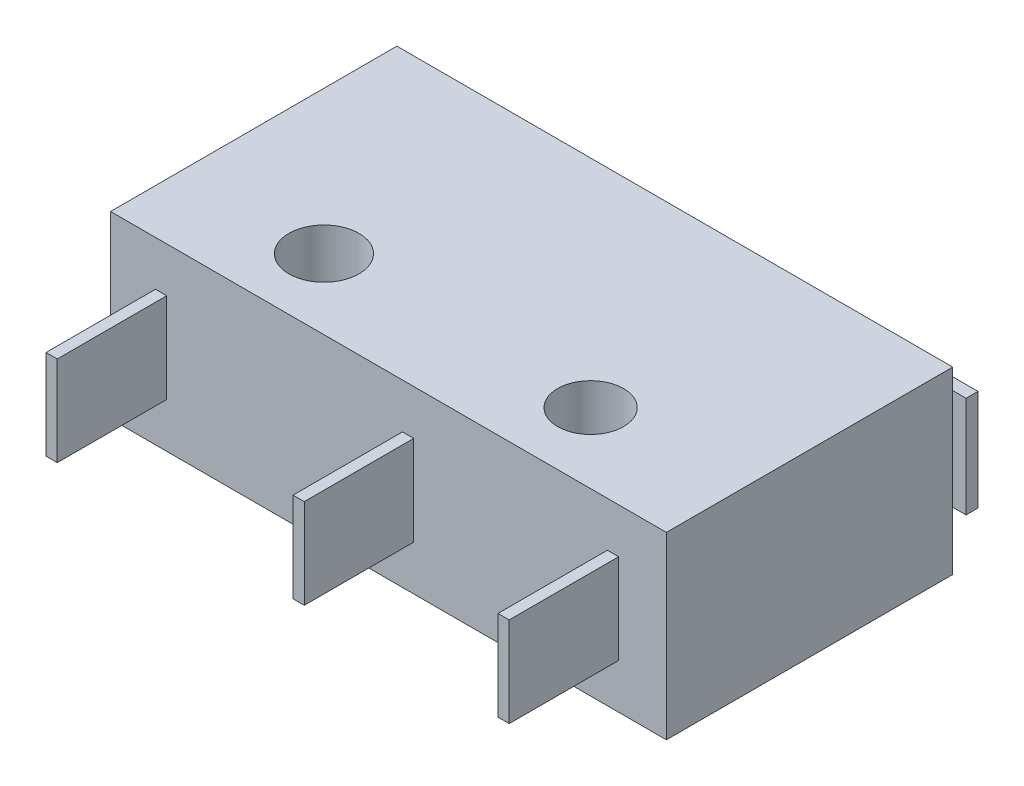
ISO-10303-21;
HEADER;
FILE_DESCRIPTION(('STEP AP214'),'2;1');
FILE_NAME('part.step','',(''),(''),'','','');
FILE_SCHEMA(('AUTOMOTIVE_DESIGN { 1 0 10303 214 1 1 1 1 }'));
ENDSEC;
DATA;
#1=APPLICATION_CONTEXT('core data for automotive mechanical design processes');
#2=APPLICATION_PROTOCOL_DEFINITION('international standard','automotive_design',2000,#1);
#3=PRODUCT_CONTEXT('',#1,'mechanical');
#4=PRODUCT('Part','Part','',(#3));
#5=PRODUCT_RELATED_PRODUCT_CATEGORY('part','',(#4));
#6=PRODUCT_DEFINITION_FORMATION('','',#4);
#7=PRODUCT_DEFINITION_CONTEXT('part definition',#1,'design');
#8=PRODUCT_DEFINITION('design','',#6,#7);
#9=PRODUCT_DEFINITION_SHAPE('','',#8);
#10=(LENGTH_UNIT() NAMED_UNIT(*) SI_UNIT(.MILLI.,.METRE.));
#11=(NAMED_UNIT(*) PLANE_ANGLE_UNIT() SI_UNIT($,.RADIAN.));
#12=(NAMED_UNIT(*) SI_UNIT($,.STERADIAN.) SOLID_ANGLE_UNIT());
#13=UNCERTAINTY_MEASURE_WITH_UNIT(LENGTH_MEASURE(1.E-05),#10,'distance_accuracy_value','');
#14=(GEOMETRIC_REPRESENTATION_CONTEXT(3) GLOBAL_UNCERTAINTY_ASSIGNED_CONTEXT((#13)) GLOBAL_UNIT_ASSIGNED_CONTEXT((#10,
#11,#12)) REPRESENTATION_CONTEXT('',''));
#15=CARTESIAN_POINT('',(0.,0.,0.));
#16=DIRECTION('',(0.,0.,1.));
#17=DIRECTION('',(1.,0.,0.));
#18=AXIS2_PLACEMENT_3D('',#15,#16,#17);
#19=CARTESIAN_POINT('',(-9.9,3.2,5.1));
#20=DIRECTION('',(0.,0.,-1.));
#21=DIRECTION('',(-1.,0.,0.));
#22=AXIS2_PLACEMENT_3D('',#19,#20,#21);
#23=PLANE('',#22);
#24=DIRECTION('',(0.,1.,0.));
#25=VECTOR('',#24,1.);
#26=CARTESIAN_POINT('',(0.9,1.6,5.1));
#27=LINE('',#26,#25);
#28=CARTESIAN_POINT('',(0.9,-1.6,5.1));
#29=VERTEX_POINT('',#28);
#30=CARTESIAN_POINT('',(0.9,1.6,5.1));
#31=VERTEX_POINT('',#30);
#32=EDGE_CURVE('E240',#29,#31,#27,.T.);
#33=ORIENTED_EDGE('',*,*,#32,.F.);
#34=DIRECTION('',(1.,0.,0.));
#35=VECTOR('',#34,1.);
#36=CARTESIAN_POINT('',(0.5,-1.6,5.1));
#37=LINE('',#36,#35);
#38=CARTESIAN_POINT('',(0.5,-1.6,5.1));
#39=VERTEX_POINT('',#38);
#40=EDGE_CURVE('E245',#39,#29,#37,.T.);
#41=ORIENTED_EDGE('',*,*,#40,.F.);
#42=DIRECTION('',(0.,-1.,0.));
#43=VECTOR('',#42,1.);
#44=CARTESIAN_POINT('',(0.5,1.6,5.1));
#45=LINE('',#44,#43);
#46=CARTESIAN_POINT('',(0.5,1.6,5.1));
#47=VERTEX_POINT('',#46);
#48=EDGE_CURVE('E257',#47,#39,#45,.T.);
#49=ORIENTED_EDGE('',*,*,#48,.F.);
#50=DIRECTION('',(-1.,0.,0.));
#51=VECTOR('',#50,1.);
#52=CARTESIAN_POINT('',(0.5,1.6,5.1));
#53=LINE('',#52,#51);
#54=EDGE_CURVE('E254',#31,#47,#53,.T.);
#55=ORIENTED_EDGE('',*,*,#54,.F.);
#56=EDGE_LOOP('',(#33,#41,#49,#55));
#57=FACE_BOUND('',#56,.T.);
#58=DIRECTION('',(1.,0.,0.));
#59=VECTOR('',#58,1.);
#60=CARTESIAN_POINT('',(-9.9,-3.2,5.1));
#61=LINE('',#60,#59);
#62=CARTESIAN_POINT('',(-9.9,-3.2,5.1));
#63=VERTEX_POINT('',#62);
#64=CARTESIAN_POINT('',(9.9,-3.2,5.1));
#65=VERTEX_POINT('',#64);
#66=EDGE_CURVE('E366',#63,#65,#61,.T.);
#67=ORIENTED_EDGE('',*,*,#66,.T.);
#68=DIRECTION('',(0.,-1.,0.));
#69=VECTOR('',#68,1.);
#70=CARTESIAN_POINT('',(9.9,3.2,5.1));
#71=LINE('',#70,#69);
#72=CARTESIAN_POINT('',(9.9,3.2,5.1));
#73=VERTEX_POINT('',#72);
#74=EDGE_CURVE('E372',#73,#65,#71,.T.);
#75=ORIENTED_EDGE('',*,*,#74,.F.);
#76=DIRECTION('',(1.,0.,0.));
#77=VECTOR('',#76,1.);
#78=CARTESIAN_POINT('',(-9.9,3.2,5.1));
#79=LINE('',#78,#77);
#80=CARTESIAN_POINT('',(-9.9,3.2,5.1));
#81=VERTEX_POINT('',#80);
#82=EDGE_CURVE('E370',#81,#73,#79,.T.);
#83=ORIENTED_EDGE('',*,*,#82,.F.);
#84=DIRECTION('',(0.,-1.,0.));
#85=VECTOR('',#84,1.);
#86=CARTESIAN_POINT('',(-9.9,3.2,5.1));
#87=LINE('',#86,#85);
#88=EDGE_CURVE('E382',#81,#63,#87,.T.);
#89=ORIENTED_EDGE('',*,*,#88,.T.);
#90=EDGE_LOOP('',(#67,#75,#83,#89));
#91=FACE_BOUND('',#90,.T.);
#92=DIRECTION('',(0.,1.,0.));
#93=VECTOR('',#92,1.);
#94=CARTESIAN_POINT('',(-7.9,1.6,5.1));
#95=LINE('',#94,#93);
#96=CARTESIAN_POINT('',(-7.9,-1.6,5.1));
#97=VERTEX_POINT('',#96);
#98=CARTESIAN_POINT('',(-7.9,1.6,5.1));
#99=VERTEX_POINT('',#98);
#100=EDGE_CURVE('E273',#97,#99,#95,.T.);
#101=ORIENTED_EDGE('',*,*,#100,.F.);
#102=DIRECTION('',(1.,0.,0.));
#103=VECTOR('',#102,1.);
#104=CARTESIAN_POINT('',(-8.3,-1.6,5.1));
#105=LINE('',#104,#103);
#106=CARTESIAN_POINT('',(-8.3,-1.6,5.1));
#107=VERTEX_POINT('',#106);
#108=EDGE_CURVE('E278',#107,#97,#105,.T.);
#109=ORIENTED_EDGE('',*,*,#108,.F.);
#110=DIRECTION('',(0.,-1.,0.));
#111=VECTOR('',#110,1.);
#112=CARTESIAN_POINT('',(-8.3,1.6,5.1));
#113=LINE('',#112,#111);
#114=CARTESIAN_POINT('',(-8.3,1.6,5.1));
#115=VERTEX_POINT('',#114);
#116=EDGE_CURVE('E290',#115,#107,#113,.T.);
#117=ORIENTED_EDGE('',*,*,#116,.F.);
#118=DIRECTION('',(-1.,0.,0.));
#119=VECTOR('',#118,1.);
#120=CARTESIAN_POINT('',(-8.3,1.6,5.1));
#121=LINE('',#120,#119);
#122=EDGE_CURVE('E287',#99,#115,#121,.T.);
#123=ORIENTED_EDGE('',*,*,#122,.F.);
#124=EDGE_LOOP('',(#101,#109,#117,#123));
#125=FACE_BOUND('',#124,.T.);
#126=DIRECTION('',(0.,1.,0.));
#127=VECTOR('',#126,1.);
#128=CARTESIAN_POINT('',(8.2,1.6,5.1));
#129=LINE('',#128,#127);
#130=CARTESIAN_POINT('',(8.2,-1.6,5.1));
#131=VERTEX_POINT('',#130);
#132=CARTESIAN_POINT('',(8.2,1.6,5.1));
#133=VERTEX_POINT('',#132);
#134=EDGE_CURVE('E205',#131,#133,#129,.T.);
#135=ORIENTED_EDGE('',*,*,#134,.F.);
#136=DIRECTION('',(1.,0.,0.));
#137=VECTOR('',#136,1.);
#138=CARTESIAN_POINT('',(7.8,-1.6,5.1));
#139=LINE('',#138,#137);
#140=CARTESIAN_POINT('',(7.8,-1.6,5.1));
#141=VERTEX_POINT('',#140);
#142=EDGE_CURVE('E212',#141,#131,#139,.T.);
#143=ORIENTED_EDGE('',*,*,#142,.F.);
#144=DIRECTION('',(0.,-1.,0.));
#145=VECTOR('',#144,1.);
#146=CARTESIAN_POINT('',(7.8,1.6,5.1));
#147=LINE('',#146,#145);
#148=CARTESIAN_POINT('',(7.8,1.6,5.1));
#149=VERTEX_POINT('',#148);
#150=EDGE_CURVE('E224',#149,#141,#147,.T.);
#151=ORIENTED_EDGE('',*,*,#150,.F.);
#152=DIRECTION('',(-1.,0.,0.));
#153=VECTOR('',#152,1.);
#154=CARTESIAN_POINT('',(7.8,1.6,5.1));
#155=LINE('',#154,#153);
#156=EDGE_CURVE('E221',#133,#149,#155,.T.);
#157=ORIENTED_EDGE('',*,*,#156,.F.);
#158=EDGE_LOOP('',(#135,#143,#151,#157));
#159=FACE_BOUND('',#158,.T.);
#160=ADVANCED_FACE('F34',(#57,#91,#125,#159),#23,.F.);
#161=CARTESIAN_POINT('',(-9.9,3.2,-5.1));
#162=DIRECTION('',(0.,0.,1.));
#163=DIRECTION('',(1.,0.,0.));
#164=AXIS2_PLACEMENT_3D('',#161,#162,#163);
#165=PLANE('',#164);
#166=DIRECTION('',(0.,-1.,0.));
#167=VECTOR('',#166,1.);
#168=CARTESIAN_POINT('',(-2.80029071826333,1.7,-5.1));
#169=LINE('',#168,#167);
#170=CARTESIAN_POINT('',(-2.80029071826333,1.7,-5.1));
#171=VERTEX_POINT('',#170);
#172=CARTESIAN_POINT('',(-2.80029071826333,-1.7,-5.1));
#173=VERTEX_POINT('',#172);
#174=EDGE_CURVE('E52',#171,#173,#169,.T.);
#175=ORIENTED_EDGE('',*,*,#174,.F.);
#176=DIRECTION('',(-1.,0.,0.));
#177=VECTOR('',#176,1.);
#178=CARTESIAN_POINT('',(-9.9,1.7,-5.1));
#179=LINE('',#178,#177);
#180=CARTESIAN_POINT('',(-3.81456377409336,1.7,-5.1));
#181=VERTEX_POINT('',#180);
#182=EDGE_CURVE('E11',#171,#181,#179,.T.);
#183=ORIENTED_EDGE('',*,*,#182,.T.);
#184=DIRECTION('',(0.,-1.,0.));
#185=VECTOR('',#184,1.);
#186=CARTESIAN_POINT('',(-3.81456377409336,1.7,-5.1));
#187=LINE('',#186,#185);
#188=CARTESIAN_POINT('',(-3.81456377409336,-1.7,-5.1));
#189=VERTEX_POINT('',#188);
#190=EDGE_CURVE('E42',#189,#181,#187,.F.);
#191=ORIENTED_EDGE('',*,*,#190,.F.);
#192=DIRECTION('',(-1.,0.,0.));
#193=VECTOR('',#192,1.);
#194=CARTESIAN_POINT('',(-9.9,-1.7,-5.1));
#195=LINE('',#194,#193);
#196=EDGE_CURVE('E191',#173,#189,#195,.T.);
#197=ORIENTED_EDGE('',*,*,#196,.F.);
#198=EDGE_LOOP('',(#175,#183,#191,#197));
#199=FACE_BOUND('',#198,.T.);
#200=DIRECTION('',(-1.,0.,0.));
#201=VECTOR('',#200,1.);
#202=CARTESIAN_POINT('',(-9.9,-3.2,-5.1));
#203=LINE('',#202,#201);
#204=CARTESIAN_POINT('',(9.9,-3.2,-5.1));
#205=VERTEX_POINT('',#204);
#206=CARTESIAN_POINT('',(-9.9,-3.2,-5.1));
#207=VERTEX_POINT('',#206);
#208=EDGE_CURVE('E375',#205,#207,#203,.T.);
#209=ORIENTED_EDGE('',*,*,#208,.T.);
#210=DIRECTION('',(0.,-1.,0.));
#211=VECTOR('',#210,1.);
#212=CARTESIAN_POINT('',(-9.9,3.2,-5.1));
#213=LINE('',#212,#211);
#214=CARTESIAN_POINT('',(-9.9,3.2,-5.1));
#215=VERTEX_POINT('',#214);
#216=EDGE_CURVE('E385',#215,#207,#213,.T.);
#217=ORIENTED_EDGE('',*,*,#216,.F.);
#218=DIRECTION('',(-1.,0.,0.));
#219=VECTOR('',#218,1.);
#220=CARTESIAN_POINT('',(-9.9,3.2,-5.1));
#221=LINE('',#220,#219);
#222=CARTESIAN_POINT('',(9.9,3.2,-5.1));
#223=VERTEX_POINT('',#222);
#224=EDGE_CURVE('E365',#223,#215,#221,.T.);
#225=ORIENTED_EDGE('',*,*,#224,.F.);
#226=DIRECTION('',(0.,-1.,0.));
#227=VECTOR('',#226,1.);
#228=CARTESIAN_POINT('',(9.9,3.2,-5.1));
#229=LINE('',#228,#227);
#230=EDGE_CURVE('E200',#223,#205,#229,.T.);
#231=ORIENTED_EDGE('',*,*,#230,.T.);
#232=EDGE_LOOP('',(#209,#217,#225,#231));
#233=FACE_BOUND('',#232,.T.);
#234=DIRECTION('',(1.,0.,0.));
#235=VECTOR('',#234,1.);
#236=CARTESIAN_POINT('',(-6.69422935085049,1.8,-5.1));
#237=LINE('',#236,#235);
#238=CARTESIAN_POINT('',(-7.3066351905182,1.8,-5.1));
#239=VERTEX_POINT('',#238);
#240=CARTESIAN_POINT('',(-6.69422935085049,1.8,-5.1));
#241=VERTEX_POINT('',#240);
#242=EDGE_CURVE('E307',#239,#241,#237,.T.);
#243=ORIENTED_EDGE('',*,*,#242,.F.);
#244=DIRECTION('',(0.,-1.,0.));
#245=VECTOR('',#244,1.);
#246=CARTESIAN_POINT('',(-7.3066351905182,1.8,-5.1));
#247=LINE('',#246,#245);
#248=CARTESIAN_POINT('',(-7.3066351905182,-1.8,-5.1));
#249=VERTEX_POINT('',#248);
#250=EDGE_CURVE('E321',#239,#249,#247,.T.);
#251=ORIENTED_EDGE('',*,*,#250,.T.);
#252=DIRECTION('',(1.,0.,0.));
#253=VECTOR('',#252,1.);
#254=CARTESIAN_POINT('',(-6.69422935085049,-1.8,-5.1));
#255=LINE('',#254,#253);
#256=CARTESIAN_POINT('',(-6.69422935085049,-1.8,-5.1));
#257=VERTEX_POINT('',#256);
#258=EDGE_CURVE('E306',#249,#257,#255,.T.);
#259=ORIENTED_EDGE('',*,*,#258,.T.);
#260=DIRECTION('',(0.,-1.,0.));
#261=VECTOR('',#260,1.);
#262=CARTESIAN_POINT('',(-6.69422935085049,1.8,-5.1));
#263=LINE('',#262,#261);
#264=EDGE_CURVE('E347',#241,#257,#263,.T.);
#265=ORIENTED_EDGE('',*,*,#264,.F.);
#266=EDGE_LOOP('',(#243,#251,#259,#265));
#267=FACE_BOUND('',#266,.T.);
#268=ADVANCED_FACE('F189',(#199,#233,#267),#165,.F.);
#269=CARTESIAN_POINT('',(9.9,3.2,5.1));
#270=DIRECTION('',(-1.,0.,0.));
#271=DIRECTION('',(0.,0.,1.));
#272=AXIS2_PLACEMENT_3D('',#269,#270,#271);
#273=PLANE('',#272);
#274=DIRECTION('',(0.,0.,-1.));
#275=VECTOR('',#274,1.);
#276=CARTESIAN_POINT('',(9.9,-3.2,5.1));
#277=LINE('',#276,#275);
#278=EDGE_CURVE('E357',#65,#205,#277,.T.);
#279=ORIENTED_EDGE('',*,*,#278,.T.);
#280=ORIENTED_EDGE('',*,*,#230,.F.);
#281=DIRECTION('',(0.,0.,-1.));
#282=VECTOR('',#281,1.);
#283=CARTESIAN_POINT('',(9.9,3.2,5.1));
#284=LINE('',#283,#282);
#285=EDGE_CURVE('E362',#73,#223,#284,.T.);
#286=ORIENTED_EDGE('',*,*,#285,.F.);
#287=ORIENTED_EDGE('',*,*,#74,.T.);
#288=EDGE_LOOP('',(#279,#280,#286,#287));
#289=FACE_BOUND('',#288,.T.);
#290=ADVANCED_FACE('F36',(#289),#273,.F.);
#291=CARTESIAN_POINT('',(-9.9,3.2,5.1));
#292=DIRECTION('',(1.,0.,0.));
#293=DIRECTION('',(0.,0.,-1.));
#294=AXIS2_PLACEMENT_3D('',#291,#292,#293);
#295=PLANE('',#294);
#296=DIRECTION('',(0.,0.,1.));
#297=VECTOR('',#296,1.);
#298=CARTESIAN_POINT('',(-9.9,-3.2,5.1));
#299=LINE('',#298,#297);
#300=EDGE_CURVE('E377',#207,#63,#299,.T.);
#301=ORIENTED_EDGE('',*,*,#300,.T.);
#302=ORIENTED_EDGE('',*,*,#88,.F.);
#303=DIRECTION('',(0.,0.,1.));
#304=VECTOR('',#303,1.);
#305=CARTESIAN_POINT('',(-9.9,3.2,5.1));
#306=LINE('',#305,#304);
#307=EDGE_CURVE('E368',#215,#81,#306,.T.);
#308=ORIENTED_EDGE('',*,*,#307,.F.);
#309=ORIENTED_EDGE('',*,*,#216,.T.);
#310=EDGE_LOOP('',(#301,#302,#308,#309));
#311=FACE_BOUND('',#310,.T.);
#312=ADVANCED_FACE('F403',(#311),#295,.F.);
#313=CARTESIAN_POINT('',(0.,3.2,0.));
#314=DIRECTION('',(0.,-1.,0.));
#315=DIRECTION('',(0.,0.,-1.));
#316=AXIS2_PLACEMENT_3D('',#313,#314,#315);
#317=PLANE('',#316);
#318=CARTESIAN_POINT('',(-4.8,3.2,2.6));
#319=DIRECTION('',(0.,1.,0.));
#320=DIRECTION('',(0.,0.,1.));
#321=AXIS2_PLACEMENT_3D('',#318,#319,#320);
#322=CIRCLE('',#321,1.25);
#323=CARTESIAN_POINT('',(-4.8,3.2,3.85));
#324=VERTEX_POINT('',#323);
#325=EDGE_CURVE('E350',#324,#324,#322,.T.);
#326=ORIENTED_EDGE('',*,*,#325,.F.);
#327=EDGE_LOOP('',(#326));
#328=FACE_BOUND('',#327,.T.);
#329=CARTESIAN_POINT('',(4.7,3.2,2.6));
#330=DIRECTION('',(0.,1.,0.));
#331=DIRECTION('',(0.,0.,1.));
#332=AXIS2_PLACEMENT_3D('',#329,#330,#331);
#333=CIRCLE('',#332,1.175);
#334=CARTESIAN_POINT('',(4.7,3.2,3.775));
#335=VERTEX_POINT('',#334);
#336=EDGE_CURVE('E349',#335,#335,#333,.T.);
#337=ORIENTED_EDGE('',*,*,#336,.F.);
#338=EDGE_LOOP('',(#337));
#339=FACE_BOUND('',#338,.T.);
#340=ORIENTED_EDGE('',*,*,#285,.T.);
#341=ORIENTED_EDGE('',*,*,#224,.T.);
#342=ORIENTED_EDGE('',*,*,#307,.T.);
#343=ORIENTED_EDGE('',*,*,#82,.T.);
#344=EDGE_LOOP('',(#340,#341,#342,#343));
#345=FACE_BOUND('',#344,.T.);
#346=ADVANCED_FACE('F409',(#328,#339,#345),#317,.F.);
#347=CARTESIAN_POINT('',(0.,-3.2,0.));
#348=DIRECTION('',(0.,-1.,0.));
#349=DIRECTION('',(0.,0.,-1.));
#350=AXIS2_PLACEMENT_3D('',#347,#348,#349);
#351=PLANE('',#350);
#352=CARTESIAN_POINT('',(-4.8,-3.2,2.6));
#353=DIRECTION('',(0.,1.,0.));
#354=DIRECTION('',(0.,0.,1.));
#355=AXIS2_PLACEMENT_3D('',#352,#353,#354);
#356=CIRCLE('',#355,1.25);
#357=CARTESIAN_POINT('',(-4.8,-3.2,3.85));
#358=VERTEX_POINT('',#357);
#359=EDGE_CURVE('E353',#358,#358,#356,.T.);
#360=ORIENTED_EDGE('',*,*,#359,.T.);
#361=EDGE_LOOP('',(#360));
#362=FACE_BOUND('',#361,.T.);
#363=CARTESIAN_POINT('',(4.7,-3.2,2.6));
#364=DIRECTION('',(0.,1.,0.));
#365=DIRECTION('',(0.,0.,1.));
#366=AXIS2_PLACEMENT_3D('',#363,#364,#365);
#367=CIRCLE('',#366,1.175);
#368=CARTESIAN_POINT('',(4.7,-3.2,3.775));
#369=VERTEX_POINT('',#368);
#370=EDGE_CURVE('E354',#369,#369,#367,.T.);
#371=ORIENTED_EDGE('',*,*,#370,.T.);
#372=EDGE_LOOP('',(#371));
#373=FACE_BOUND('',#372,.T.);
#374=ORIENTED_EDGE('',*,*,#278,.F.);
#375=ORIENTED_EDGE('',*,*,#66,.F.);
#376=ORIENTED_EDGE('',*,*,#300,.F.);
#377=ORIENTED_EDGE('',*,*,#208,.F.);
#378=EDGE_LOOP('',(#374,#375,#376,#377));
#379=FACE_BOUND('',#378,.T.);
#380=ADVANCED_FACE('F399',(#362,#373,#379),#351,.T.);
#381=CARTESIAN_POINT('',(4.7,-3.2,2.6));
#382=DIRECTION('',(0.,1.,0.));
#383=DIRECTION('',(0.,0.,1.));
#384=AXIS2_PLACEMENT_3D('',#381,#382,#383);
#385=CYLINDRICAL_SURFACE('',#384,1.175);
#386=ORIENTED_EDGE('',*,*,#370,.F.);
#387=EDGE_LOOP('',(#386));
#388=FACE_BOUND('',#387,.T.);
#389=ORIENTED_EDGE('',*,*,#336,.T.);
#390=EDGE_LOOP('',(#389));
#391=FACE_BOUND('',#390,.T.);
#392=ADVANCED_FACE('F417',(#388,#391),#385,.F.);
#393=CARTESIAN_POINT('',(-4.8,-3.2,2.6));
#394=DIRECTION('',(0.,1.,0.));
#395=DIRECTION('',(0.,0.,1.));
#396=AXIS2_PLACEMENT_3D('',#393,#394,#395);
#397=CYLINDRICAL_SURFACE('',#396,1.25);
#398=ORIENTED_EDGE('',*,*,#359,.F.);
#399=EDGE_LOOP('',(#398));
#400=FACE_BOUND('',#399,.T.);
#401=ORIENTED_EDGE('',*,*,#325,.T.);
#402=EDGE_LOOP('',(#401));
#403=FACE_BOUND('',#402,.T.);
#404=ADVANCED_FACE('F504',(#400,#403),#397,.F.);
#405=CARTESIAN_POINT('',(-6.69422935085049,1.8,-5.77562059134893));
#406=DIRECTION('',(-1.,0.,0.));
#407=DIRECTION('',(0.,0.,1.));
#408=AXIS2_PLACEMENT_3D('',#405,#406,#407);
#409=PLANE('',#408);
#410=DIRECTION('',(0.,0.,-1.));
#411=VECTOR('',#410,1.);
#412=CARTESIAN_POINT('',(-6.69422935085049,-1.8,-5.77562059134893));
#413=LINE('',#412,#411);
#414=CARTESIAN_POINT('',(-6.69422935085049,-1.8,-5.77562059134893));
#415=VERTEX_POINT('',#414);
#416=EDGE_CURVE('E324',#257,#415,#413,.T.);
#417=ORIENTED_EDGE('',*,*,#416,.T.);
#418=DIRECTION('',(0.,-1.,0.));
#419=VECTOR('',#418,1.);
#420=CARTESIAN_POINT('',(-6.69422935085049,1.8,-5.77562059134893));
#421=LINE('',#420,#419);
#422=CARTESIAN_POINT('',(-6.69422935085049,1.8,-5.77562059134893));
#423=VERTEX_POINT('',#422);
#424=EDGE_CURVE('E344',#423,#415,#421,.T.);
#425=ORIENTED_EDGE('',*,*,#424,.F.);
#426=DIRECTION('',(0.,0.,-1.));
#427=VECTOR('',#426,1.);
#428=CARTESIAN_POINT('',(-6.69422935085049,1.8,-5.77562059134893));
#429=LINE('',#428,#427);
#430=EDGE_CURVE('E310',#241,#423,#429,.T.);
#431=ORIENTED_EDGE('',*,*,#430,.F.);
#432=ORIENTED_EDGE('',*,*,#264,.T.);
#433=EDGE_LOOP('',(#417,#425,#431,#432));
#434=FACE_BOUND('',#433,.T.);
#435=ADVANCED_FACE('F500',(#434),#409,.F.);
#436=CARTESIAN_POINT('',(9.7,1.8,-5.77562059134893));
#437=DIRECTION('',(0.,0.,-1.));
#438=DIRECTION('',(-1.,0.,0.));
#439=AXIS2_PLACEMENT_3D('',#436,#437,#438);
#440=PLANE('',#439);
#441=DIRECTION('',(1.,0.,0.));
#442=VECTOR('',#441,1.);
#443=CARTESIAN_POINT('',(9.7,-1.8,-5.77562059134893));
#444=LINE('',#443,#442);
#445=CARTESIAN_POINT('',(9.7,-1.8,-5.77562059134893));
#446=VERTEX_POINT('',#445);
#447=EDGE_CURVE('E326',#415,#446,#444,.T.);
#448=ORIENTED_EDGE('',*,*,#447,.T.);
#449=DIRECTION('',(0.,-1.,0.));
#450=VECTOR('',#449,1.);
#451=CARTESIAN_POINT('',(9.7,1.8,-5.77562059134893));
#452=LINE('',#451,#450);
#453=CARTESIAN_POINT('',(9.7,1.8,-5.77562059134893));
#454=VERTEX_POINT('',#453);
#455=EDGE_CURVE('E341',#454,#446,#452,.T.);
#456=ORIENTED_EDGE('',*,*,#455,.F.);
#457=DIRECTION('',(1.,0.,0.));
#458=VECTOR('',#457,1.);
#459=CARTESIAN_POINT('',(9.7,1.8,-5.77562059134893));
#460=LINE('',#459,#458);
#461=EDGE_CURVE('E313',#423,#454,#460,.T.);
#462=ORIENTED_EDGE('',*,*,#461,.F.);
#463=ORIENTED_EDGE('',*,*,#424,.T.);
#464=EDGE_LOOP('',(#448,#456,#462,#463));
#465=FACE_BOUND('',#464,.T.);
#466=ADVANCED_FACE('F496',(#465),#440,.F.);
#467=CARTESIAN_POINT('',(9.7,1.8,-6.2));
#468=DIRECTION('',(-1.,0.,0.));
#469=DIRECTION('',(0.,0.,1.));
#470=AXIS2_PLACEMENT_3D('',#467,#468,#469);
#471=PLANE('',#470);
#472=DIRECTION('',(0.,0.,-1.));
#473=VECTOR('',#472,1.);
#474=CARTESIAN_POINT('',(9.7,-1.8,-6.2));
#475=LINE('',#474,#473);
#476=CARTESIAN_POINT('',(9.7,-1.8,-6.2));
#477=VERTEX_POINT('',#476);
#478=EDGE_CURVE('E328',#446,#477,#475,.T.);
#479=ORIENTED_EDGE('',*,*,#478,.T.);
#480=DIRECTION('',(0.,-1.,0.));
#481=VECTOR('',#480,1.);
#482=CARTESIAN_POINT('',(9.7,1.8,-6.2));
#483=LINE('',#482,#481);
#484=CARTESIAN_POINT('',(9.7,1.8,-6.2));
#485=VERTEX_POINT('',#484);
#486=EDGE_CURVE('E338',#485,#477,#483,.T.);
#487=ORIENTED_EDGE('',*,*,#486,.F.);
#488=DIRECTION('',(0.,0.,-1.));
#489=VECTOR('',#488,1.);
#490=CARTESIAN_POINT('',(9.7,1.8,-6.2));
#491=LINE('',#490,#489);
#492=EDGE_CURVE('E315',#454,#485,#491,.T.);
#493=ORIENTED_EDGE('',*,*,#492,.F.);
#494=ORIENTED_EDGE('',*,*,#455,.T.);
#495=EDGE_LOOP('',(#479,#487,#493,#494));
#496=FACE_BOUND('',#495,.T.);
#497=ADVANCED_FACE('F492',(#496),#471,.F.);
#498=CARTESIAN_POINT('',(-7.3066351905182,1.8,-6.2));
#499=DIRECTION('',(0.,0.,1.));
#500=DIRECTION('',(1.,0.,0.));
#501=AXIS2_PLACEMENT_3D('',#498,#499,#500);
#502=PLANE('',#501);
#503=DIRECTION('',(-1.,0.,0.));
#504=VECTOR('',#503,1.);
#505=CARTESIAN_POINT('',(-7.3066351905182,-1.8,-6.2));
#506=LINE('',#505,#504);
#507=CARTESIAN_POINT('',(-7.3066351905182,-1.8,-6.2));
#508=VERTEX_POINT('',#507);
#509=EDGE_CURVE('E330',#477,#508,#506,.T.);
#510=ORIENTED_EDGE('',*,*,#509,.T.);
#511=DIRECTION('',(0.,-1.,0.));
#512=VECTOR('',#511,1.);
#513=CARTESIAN_POINT('',(-7.3066351905182,1.8,-6.2));
#514=LINE('',#513,#512);
#515=CARTESIAN_POINT('',(-7.3066351905182,1.8,-6.2));
#516=VERTEX_POINT('',#515);
#517=EDGE_CURVE('E335',#516,#508,#514,.T.);
#518=ORIENTED_EDGE('',*,*,#517,.F.);
#519=DIRECTION('',(-1.,0.,0.));
#520=VECTOR('',#519,1.);
#521=CARTESIAN_POINT('',(-7.3066351905182,1.8,-6.2));
#522=LINE('',#521,#520);
#523=EDGE_CURVE('E317',#485,#516,#522,.T.);
#524=ORIENTED_EDGE('',*,*,#523,.F.);
#525=ORIENTED_EDGE('',*,*,#486,.T.);
#526=EDGE_LOOP('',(#510,#518,#524,#525));
#527=FACE_BOUND('',#526,.T.);
#528=ADVANCED_FACE('F488',(#527),#502,.F.);
#529=CARTESIAN_POINT('',(-7.3066351905182,1.8,-5.1));
#530=DIRECTION('',(1.,0.,0.));
#531=DIRECTION('',(0.,0.,-1.));
#532=AXIS2_PLACEMENT_3D('',#529,#530,#531);
#533=PLANE('',#532);
#534=DIRECTION('',(0.,0.,1.));
#535=VECTOR('',#534,1.);
#536=CARTESIAN_POINT('',(-7.3066351905182,-1.8,-5.1));
#537=LINE('',#536,#535);
#538=EDGE_CURVE('E311',#508,#249,#537,.T.);
#539=ORIENTED_EDGE('',*,*,#538,.T.);
#540=ORIENTED_EDGE('',*,*,#250,.F.);
#541=DIRECTION('',(0.,0.,1.));
#542=VECTOR('',#541,1.);
#543=CARTESIAN_POINT('',(-7.3066351905182,1.8,-5.1));
#544=LINE('',#543,#542);
#545=EDGE_CURVE('E319',#516,#239,#544,.T.);
#546=ORIENTED_EDGE('',*,*,#545,.F.);
#547=ORIENTED_EDGE('',*,*,#517,.T.);
#548=EDGE_LOOP('',(#539,#540,#546,#547));
#549=FACE_BOUND('',#548,.T.);
#550=ADVANCED_FACE('F481',(#549),#533,.F.);
#551=CARTESIAN_POINT('',(0.,1.8,0.));
#552=DIRECTION('',(0.,-1.,0.));
#553=DIRECTION('',(0.,0.,-1.));
#554=AXIS2_PLACEMENT_3D('',#551,#552,#553);
#555=PLANE('',#554);
#556=ORIENTED_EDGE('',*,*,#242,.T.);
#557=ORIENTED_EDGE('',*,*,#430,.T.);
#558=ORIENTED_EDGE('',*,*,#461,.T.);
#559=ORIENTED_EDGE('',*,*,#492,.T.);
#560=ORIENTED_EDGE('',*,*,#523,.T.);
#561=ORIENTED_EDGE('',*,*,#545,.T.);
#562=EDGE_LOOP('',(#556,#557,#558,#559,#560,#561));
#563=FACE_BOUND('',#562,.T.);
#564=ADVANCED_FACE('F478',(#563),#555,.F.);
#565=CARTESIAN_POINT('',(0.,-1.8,0.));
#566=DIRECTION('',(0.,-1.,0.));
#567=DIRECTION('',(0.,0.,-1.));
#568=AXIS2_PLACEMENT_3D('',#565,#566,#567);
#569=PLANE('',#568);
#570=ORIENTED_EDGE('',*,*,#258,.F.);
#571=ORIENTED_EDGE('',*,*,#538,.F.);
#572=ORIENTED_EDGE('',*,*,#509,.F.);
#573=ORIENTED_EDGE('',*,*,#478,.F.);
#574=ORIENTED_EDGE('',*,*,#447,.F.);
#575=ORIENTED_EDGE('',*,*,#416,.F.);
#576=EDGE_LOOP('',(#570,#571,#572,#573,#574,#575));
#577=FACE_BOUND('',#576,.T.);
#578=ADVANCED_FACE('F476',(#577),#569,.T.);
#579=CARTESIAN_POINT('',(-7.9,1.6,9.));
#580=DIRECTION('',(-1.,0.,0.));
#581=DIRECTION('',(0.,0.,1.));
#582=AXIS2_PLACEMENT_3D('',#579,#580,#581);
#583=PLANE('',#582);
#584=ORIENTED_EDGE('',*,*,#100,.T.);
#585=DIRECTION('',(0.,0.,-1.));
#586=VECTOR('',#585,1.);
#587=CARTESIAN_POINT('',(-7.9,1.6,9.));
#588=LINE('',#587,#586);
#589=CARTESIAN_POINT('',(-7.9,1.6,9.));
#590=VERTEX_POINT('',#589);
#591=EDGE_CURVE('E303',#590,#99,#588,.T.);
#592=ORIENTED_EDGE('',*,*,#591,.F.);
#593=DIRECTION('',(0.,1.,0.));
#594=VECTOR('',#593,1.);
#595=CARTESIAN_POINT('',(-7.9,1.6,9.));
#596=LINE('',#595,#594);
#597=CARTESIAN_POINT('',(-7.9,-1.6,9.));
#598=VERTEX_POINT('',#597);
#599=EDGE_CURVE('E274',#598,#590,#596,.T.);
#600=ORIENTED_EDGE('',*,*,#599,.F.);
#601=DIRECTION('',(0.,0.,-1.));
#602=VECTOR('',#601,1.);
#603=CARTESIAN_POINT('',(-7.9,-1.6,9.));
#604=LINE('',#603,#602);
#605=EDGE_CURVE('E284',#598,#97,#604,.T.);
#606=ORIENTED_EDGE('',*,*,#605,.T.);
#607=EDGE_LOOP('',(#584,#592,#600,#606));
#608=FACE_BOUND('',#607,.T.);
#609=ADVANCED_FACE('F472',(#608),#583,.F.);
#610=CARTESIAN_POINT('',(-8.3,1.6,9.));
#611=DIRECTION('',(0.,-1.,0.));
#612=DIRECTION('',(0.,0.,-1.));
#613=AXIS2_PLACEMENT_3D('',#610,#611,#612);
#614=PLANE('',#613);
#615=ORIENTED_EDGE('',*,*,#122,.T.);
#616=DIRECTION('',(0.,0.,-1.));
#617=VECTOR('',#616,1.);
#618=CARTESIAN_POINT('',(-8.3,1.6,9.));
#619=LINE('',#618,#617);
#620=CARTESIAN_POINT('',(-8.3,1.6,9.));
#621=VERTEX_POINT('',#620);
#622=EDGE_CURVE('E300',#621,#115,#619,.T.);
#623=ORIENTED_EDGE('',*,*,#622,.F.);
#624=DIRECTION('',(-1.,0.,0.));
#625=VECTOR('',#624,1.);
#626=CARTESIAN_POINT('',(-8.3,1.6,9.));
#627=LINE('',#626,#625);
#628=EDGE_CURVE('E277',#590,#621,#627,.T.);
#629=ORIENTED_EDGE('',*,*,#628,.F.);
#630=ORIENTED_EDGE('',*,*,#591,.T.);
#631=EDGE_LOOP('',(#615,#623,#629,#630));
#632=FACE_BOUND('',#631,.T.);
#633=ADVANCED_FACE('F468',(#632),#614,.F.);
#634=CARTESIAN_POINT('',(-8.3,1.6,9.));
#635=DIRECTION('',(1.,0.,0.));
#636=DIRECTION('',(0.,0.,-1.));
#637=AXIS2_PLACEMENT_3D('',#634,#635,#636);
#638=PLANE('',#637);
#639=ORIENTED_EDGE('',*,*,#116,.T.);
#640=DIRECTION('',(0.,0.,-1.));
#641=VECTOR('',#640,1.);
#642=CARTESIAN_POINT('',(-8.3,-1.6,9.));
#643=LINE('',#642,#641);
#644=CARTESIAN_POINT('',(-8.3,-1.6,9.));
#645=VERTEX_POINT('',#644);
#646=EDGE_CURVE('E297',#645,#107,#643,.T.);
#647=ORIENTED_EDGE('',*,*,#646,.F.);
#648=DIRECTION('',(0.,-1.,0.));
#649=VECTOR('',#648,1.);
#650=CARTESIAN_POINT('',(-8.3,1.6,9.));
#651=LINE('',#650,#649);
#652=EDGE_CURVE('E280',#621,#645,#651,.T.);
#653=ORIENTED_EDGE('',*,*,#652,.F.);
#654=ORIENTED_EDGE('',*,*,#622,.T.);
#655=EDGE_LOOP('',(#639,#647,#653,#654));
#656=FACE_BOUND('',#655,.T.);
#657=ADVANCED_FACE('F464',(#656),#638,.F.);
#658=CARTESIAN_POINT('',(-8.3,-1.6,9.));
#659=DIRECTION('',(0.,1.,0.));
#660=DIRECTION('',(0.,0.,1.));
#661=AXIS2_PLACEMENT_3D('',#658,#659,#660);
#662=PLANE('',#661);
#663=ORIENTED_EDGE('',*,*,#108,.T.);
#664=ORIENTED_EDGE('',*,*,#605,.F.);
#665=DIRECTION('',(1.,0.,0.));
#666=VECTOR('',#665,1.);
#667=CARTESIAN_POINT('',(-8.3,-1.6,9.));
#668=LINE('',#667,#666);
#669=EDGE_CURVE('E282',#645,#598,#668,.T.);
#670=ORIENTED_EDGE('',*,*,#669,.F.);
#671=ORIENTED_EDGE('',*,*,#646,.T.);
#672=EDGE_LOOP('',(#663,#664,#670,#671));
#673=FACE_BOUND('',#672,.T.);
#674=ADVANCED_FACE('F460',(#673),#662,.F.);
#675=CARTESIAN_POINT('',(0.,0.,9.));
#676=DIRECTION('',(0.,0.,1.));
#677=DIRECTION('',(1.,0.,0.));
#678=AXIS2_PLACEMENT_3D('',#675,#676,#677);
#679=PLANE('',#678);
#680=ORIENTED_EDGE('',*,*,#599,.T.);
#681=ORIENTED_EDGE('',*,*,#628,.T.);
#682=ORIENTED_EDGE('',*,*,#652,.T.);
#683=ORIENTED_EDGE('',*,*,#669,.T.);
#684=EDGE_LOOP('',(#680,#681,#682,#683));
#685=FACE_BOUND('',#684,.T.);
#686=ADVANCED_FACE('F454',(#685),#679,.T.);
#687=CARTESIAN_POINT('',(0.9,1.6,9.));
#688=DIRECTION('',(-1.,0.,0.));
#689=DIRECTION('',(0.,0.,1.));
#690=AXIS2_PLACEMENT_3D('',#687,#688,#689);
#691=PLANE('',#690);
#692=ORIENTED_EDGE('',*,*,#32,.T.);
#693=DIRECTION('',(0.,0.,-1.));
#694=VECTOR('',#693,1.);
#695=CARTESIAN_POINT('',(0.9,1.6,9.));
#696=LINE('',#695,#694);
#697=CARTESIAN_POINT('',(0.9,1.6,9.));
#698=VERTEX_POINT('',#697);
#699=EDGE_CURVE('E270',#698,#31,#696,.T.);
#700=ORIENTED_EDGE('',*,*,#699,.F.);
#701=DIRECTION('',(0.,1.,0.));
#702=VECTOR('',#701,1.);
#703=CARTESIAN_POINT('',(0.9,1.6,9.));
#704=LINE('',#703,#702);
#705=CARTESIAN_POINT('',(0.9,-1.6,9.));
#706=VERTEX_POINT('',#705);
#707=EDGE_CURVE('E241',#706,#698,#704,.T.);
#708=ORIENTED_EDGE('',*,*,#707,.F.);
#709=DIRECTION('',(0.,0.,-1.));
#710=VECTOR('',#709,1.);
#711=CARTESIAN_POINT('',(0.9,-1.6,9.));
#712=LINE('',#711,#710);
#713=EDGE_CURVE('E251',#706,#29,#712,.T.);
#714=ORIENTED_EDGE('',*,*,#713,.T.);
#715=EDGE_LOOP('',(#692,#700,#708,#714));
#716=FACE_BOUND('',#715,.T.);
#717=ADVANCED_FACE('F438',(#716),#691,.F.);
#718=CARTESIAN_POINT('',(0.5,1.6,9.));
#719=DIRECTION('',(0.,-1.,0.));
#720=DIRECTION('',(0.,0.,-1.));
#721=AXIS2_PLACEMENT_3D('',#718,#719,#720);
#722=PLANE('',#721);
#723=ORIENTED_EDGE('',*,*,#54,.T.);
#724=DIRECTION('',(0.,0.,-1.));
#725=VECTOR('',#724,1.);
#726=CARTESIAN_POINT('',(0.5,1.6,9.));
#727=LINE('',#726,#725);
#728=CARTESIAN_POINT('',(0.5,1.6,9.));
#729=VERTEX_POINT('',#728);
#730=EDGE_CURVE('E267',#729,#47,#727,.T.);
#731=ORIENTED_EDGE('',*,*,#730,.F.);
#732=DIRECTION('',(-1.,0.,0.));
#733=VECTOR('',#732,1.);
#734=CARTESIAN_POINT('',(0.5,1.6,9.));
#735=LINE('',#734,#733);
#736=EDGE_CURVE('E244',#698,#729,#735,.T.);
#737=ORIENTED_EDGE('',*,*,#736,.F.);
#738=ORIENTED_EDGE('',*,*,#699,.T.);
#739=EDGE_LOOP('',(#723,#731,#737,#738));
#740=FACE_BOUND('',#739,.T.);
#741=ADVANCED_FACE('F446',(#740),#722,.F.);
#742=CARTESIAN_POINT('',(0.5,1.6,9.));
#743=DIRECTION('',(1.,0.,0.));
#744=DIRECTION('',(0.,0.,-1.));
#745=AXIS2_PLACEMENT_3D('',#742,#743,#744);
#746=PLANE('',#745);
#747=ORIENTED_EDGE('',*,*,#48,.T.);
#748=DIRECTION('',(0.,0.,-1.));
#749=VECTOR('',#748,1.);
#750=CARTESIAN_POINT('',(0.5,-1.6,9.));
#751=LINE('',#750,#749);
#752=CARTESIAN_POINT('',(0.5,-1.6,9.));
#753=VERTEX_POINT('',#752);
#754=EDGE_CURVE('E264',#753,#39,#751,.T.);
#755=ORIENTED_EDGE('',*,*,#754,.F.);
#756=DIRECTION('',(0.,-1.,0.));
#757=VECTOR('',#756,1.);
#758=CARTESIAN_POINT('',(0.5,1.6,9.));
#759=LINE('',#758,#757);
#760=EDGE_CURVE('E247',#729,#753,#759,.T.);
#761=ORIENTED_EDGE('',*,*,#760,.F.);
#762=ORIENTED_EDGE('',*,*,#730,.T.);
#763=EDGE_LOOP('',(#747,#755,#761,#762));
#764=FACE_BOUND('',#763,.T.);
#765=ADVANCED_FACE('F444',(#764),#746,.F.);
#766=CARTESIAN_POINT('',(0.5,-1.6,9.));
#767=DIRECTION('',(0.,1.,0.));
#768=DIRECTION('',(0.,0.,1.));
#769=AXIS2_PLACEMENT_3D('',#766,#767,#768);
#770=PLANE('',#769);
#771=ORIENTED_EDGE('',*,*,#40,.T.);
#772=ORIENTED_EDGE('',*,*,#713,.F.);
#773=DIRECTION('',(1.,0.,0.));
#774=VECTOR('',#773,1.);
#775=CARTESIAN_POINT('',(0.5,-1.6,9.));
#776=LINE('',#775,#774);
#777=EDGE_CURVE('E249',#753,#706,#776,.T.);
#778=ORIENTED_EDGE('',*,*,#777,.F.);
#779=ORIENTED_EDGE('',*,*,#754,.T.);
#780=EDGE_LOOP('',(#771,#772,#778,#779));
#781=FACE_BOUND('',#780,.T.);
#782=ADVANCED_FACE('F434',(#781),#770,.F.);
#783=CARTESIAN_POINT('',(8.8,0.,9.));
#784=DIRECTION('',(0.,0.,1.));
#785=DIRECTION('',(1.,0.,0.));
#786=AXIS2_PLACEMENT_3D('',#783,#784,#785);
#787=PLANE('',#786);
#788=ORIENTED_EDGE('',*,*,#707,.T.);
#789=ORIENTED_EDGE('',*,*,#736,.T.);
#790=ORIENTED_EDGE('',*,*,#760,.T.);
#791=ORIENTED_EDGE('',*,*,#777,.T.);
#792=EDGE_LOOP('',(#788,#789,#790,#791));
#793=FACE_BOUND('',#792,.T.);
#794=ADVANCED_FACE('F440',(#793),#787,.T.);
#795=CARTESIAN_POINT('',(8.2,1.6,9.));
#796=DIRECTION('',(-1.,0.,0.));
#797=DIRECTION('',(0.,0.,1.));
#798=AXIS2_PLACEMENT_3D('',#795,#796,#797);
#799=PLANE('',#798);
#800=ORIENTED_EDGE('',*,*,#134,.T.);
#801=DIRECTION('',(0.,0.,-1.));
#802=VECTOR('',#801,1.);
#803=CARTESIAN_POINT('',(8.2,1.6,9.));
#804=LINE('',#803,#802);
#805=CARTESIAN_POINT('',(8.2,1.6,9.));
#806=VERTEX_POINT('',#805);
#807=EDGE_CURVE('E237',#806,#133,#804,.T.);
#808=ORIENTED_EDGE('',*,*,#807,.F.);
#809=DIRECTION('',(0.,1.,0.));
#810=VECTOR('',#809,1.);
#811=CARTESIAN_POINT('',(8.2,1.6,9.));
#812=LINE('',#811,#810);
#813=CARTESIAN_POINT('',(8.2,-1.6,9.));
#814=VERTEX_POINT('',#813);
#815=EDGE_CURVE('E208',#814,#806,#812,.T.);
#816=ORIENTED_EDGE('',*,*,#815,.F.);
#817=DIRECTION('',(0.,0.,-1.));
#818=VECTOR('',#817,1.);
#819=CARTESIAN_POINT('',(8.2,-1.6,9.));
#820=LINE('',#819,#818);
#821=EDGE_CURVE('E218',#814,#131,#820,.T.);
#822=ORIENTED_EDGE('',*,*,#821,.T.);
#823=EDGE_LOOP('',(#800,#808,#816,#822));
#824=FACE_BOUND('',#823,.T.);
#825=ADVANCED_FACE('F619',(#824),#799,.F.);
#826=CARTESIAN_POINT('',(7.8,1.6,9.));
#827=DIRECTION('',(0.,-1.,0.));
#828=DIRECTION('',(0.,0.,-1.));
#829=AXIS2_PLACEMENT_3D('',#826,#827,#828);
#830=PLANE('',#829);
#831=ORIENTED_EDGE('',*,*,#156,.T.);
#832=DIRECTION('',(0.,0.,-1.));
#833=VECTOR('',#832,1.);
#834=CARTESIAN_POINT('',(7.8,1.6,9.));
#835=LINE('',#834,#833);
#836=CARTESIAN_POINT('',(7.8,1.6,9.));
#837=VERTEX_POINT('',#836);
#838=EDGE_CURVE('E234',#837,#149,#835,.T.);
#839=ORIENTED_EDGE('',*,*,#838,.F.);
#840=DIRECTION('',(-1.,0.,0.));
#841=VECTOR('',#840,1.);
#842=CARTESIAN_POINT('',(7.8,1.6,9.));
#843=LINE('',#842,#841);
#844=EDGE_CURVE('E211',#806,#837,#843,.T.);
#845=ORIENTED_EDGE('',*,*,#844,.F.);
#846=ORIENTED_EDGE('',*,*,#807,.T.);
#847=EDGE_LOOP('',(#831,#839,#845,#846));
#848=FACE_BOUND('',#847,.T.);
#849=ADVANCED_FACE('F609',(#848),#830,.F.);
#850=CARTESIAN_POINT('',(7.8,1.6,9.));
#851=DIRECTION('',(1.,0.,0.));
#852=DIRECTION('',(0.,0.,-1.));
#853=AXIS2_PLACEMENT_3D('',#850,#851,#852);
#854=PLANE('',#853);
#855=ORIENTED_EDGE('',*,*,#150,.T.);
#856=DIRECTION('',(0.,0.,-1.));
#857=VECTOR('',#856,1.);
#858=CARTESIAN_POINT('',(7.8,-1.6,9.));
#859=LINE('',#858,#857);
#860=CARTESIAN_POINT('',(7.8,-1.6,9.));
#861=VERTEX_POINT('',#860);
#862=EDGE_CURVE('E231',#861,#141,#859,.T.);
#863=ORIENTED_EDGE('',*,*,#862,.F.);
#864=DIRECTION('',(0.,-1.,0.));
#865=VECTOR('',#864,1.);
#866=CARTESIAN_POINT('',(7.8,1.6,9.));
#867=LINE('',#866,#865);
#868=EDGE_CURVE('E214',#837,#861,#867,.T.);
#869=ORIENTED_EDGE('',*,*,#868,.F.);
#870=ORIENTED_EDGE('',*,*,#838,.T.);
#871=EDGE_LOOP('',(#855,#863,#869,#870));
#872=FACE_BOUND('',#871,.T.);
#873=ADVANCED_FACE('F599',(#872),#854,.F.);
#874=CARTESIAN_POINT('',(7.8,-1.6,9.));
#875=DIRECTION('',(0.,1.,0.));
#876=DIRECTION('',(0.,0.,1.));
#877=AXIS2_PLACEMENT_3D('',#874,#875,#876);
#878=PLANE('',#877);
#879=ORIENTED_EDGE('',*,*,#142,.T.);
#880=ORIENTED_EDGE('',*,*,#821,.F.);
#881=DIRECTION('',(1.,0.,0.));
#882=VECTOR('',#881,1.);
#883=CARTESIAN_POINT('',(7.8,-1.6,9.));
#884=LINE('',#883,#882);
#885=EDGE_CURVE('E216',#861,#814,#884,.T.);
#886=ORIENTED_EDGE('',*,*,#885,.F.);
#887=ORIENTED_EDGE('',*,*,#862,.T.);
#888=EDGE_LOOP('',(#879,#880,#886,#887));
#889=FACE_BOUND('',#888,.T.);
#890=ADVANCED_FACE('F587',(#889),#878,.F.);
#891=CARTESIAN_POINT('',(16.1,0.,9.));
#892=DIRECTION('',(0.,0.,1.));
#893=DIRECTION('',(1.,0.,0.));
#894=AXIS2_PLACEMENT_3D('',#891,#892,#893);
#895=PLANE('',#894);
#896=ORIENTED_EDGE('',*,*,#815,.T.);
#897=ORIENTED_EDGE('',*,*,#844,.T.);
#898=ORIENTED_EDGE('',*,*,#868,.T.);
#899=ORIENTED_EDGE('',*,*,#885,.T.);
#900=EDGE_LOOP('',(#896,#897,#898,#899));
#901=FACE_BOUND('',#900,.T.);
#902=ADVANCED_FACE('F582',(#901),#895,.T.);
#903=CARTESIAN_POINT('',(-3.30742724617835,1.7,-5.1));
#904=DIRECTION('',(0.,-1.,0.));
#905=DIRECTION('',(0.,0.,-1.));
#906=AXIS2_PLACEMENT_3D('',#903,#904,#905);
#907=CYLINDRICAL_SURFACE('',#906,0.507136527915017);
#908=CARTESIAN_POINT('',(-3.30742724617835,-1.7,-5.1));
#909=DIRECTION('',(0.,1.,0.));
#910=DIRECTION('',(0.,0.,1.));
#911=AXIS2_PLACEMENT_3D('',#908,#909,#910);
#912=CIRCLE('',#911,0.507136527915017);
#913=EDGE_CURVE('E199',#173,#189,#912,.T.);
#914=ORIENTED_EDGE('',*,*,#913,.T.);
#915=ORIENTED_EDGE('',*,*,#190,.T.);
#916=CARTESIAN_POINT('',(-3.30742724617835,1.7,-5.1));
#917=DIRECTION('',(0.,1.,0.));
#918=DIRECTION('',(0.,0.,1.));
#919=AXIS2_PLACEMENT_3D('',#916,#917,#918);
#920=CIRCLE('',#919,0.507136527915017);
#921=EDGE_CURVE('E203',#171,#181,#920,.T.);
#922=ORIENTED_EDGE('',*,*,#921,.F.);
#923=ORIENTED_EDGE('',*,*,#174,.T.);
#924=EDGE_LOOP('',(#914,#915,#922,#923));
#925=FACE_BOUND('',#924,.T.);
#926=ADVANCED_FACE('F202',(#925),#907,.T.);
#927=CARTESIAN_POINT('',(-3.30742724617835,1.7,-5.1));
#928=DIRECTION('',(0.,1.,0.));
#929=DIRECTION('',(0.,0.,1.));
#930=AXIS2_PLACEMENT_3D('',#927,#928,#929);
#931=PLANE('',#930);
#932=ORIENTED_EDGE('',*,*,#182,.F.);
#933=ORIENTED_EDGE('',*,*,#921,.T.);
#934=EDGE_LOOP('',(#932,#933));
#935=FACE_BOUND('',#934,.T.);
#936=ADVANCED_FACE('F715',(#935),#931,.T.);
#937=CARTESIAN_POINT('',(-3.30742724617835,-1.7,-5.1));
#938=DIRECTION('',(0.,1.,0.));
#939=DIRECTION('',(0.,0.,1.));
#940=AXIS2_PLACEMENT_3D('',#937,#938,#939);
#941=PLANE('',#940);
#942=ORIENTED_EDGE('',*,*,#913,.F.);
#943=ORIENTED_EDGE('',*,*,#196,.T.);
#944=EDGE_LOOP('',(#942,#943));
#945=FACE_BOUND('',#944,.T.);
#946=ADVANCED_FACE('F198',(#945),#941,.F.);
#947=CLOSED_SHELL('',(#160,#268,#290,#312,#346,#380,#392,#404,#435,#466,#497,#528,#550,#564,
#578,#609,#633,#657,#674,#686,#717,#741,#765,#782,#794,#825,#849,#873,#890,#902,#926,#936,#946));
#948=MANIFOLD_SOLID_BREP('B2',#947);
#949=ADVANCED_BREP_SHAPE_REPRESENTATION('',(#18,#948),#14);
#950=SHAPE_DEFINITION_REPRESENTATION(#9,#949);
ENDSEC;
END-ISO-10303-21;
